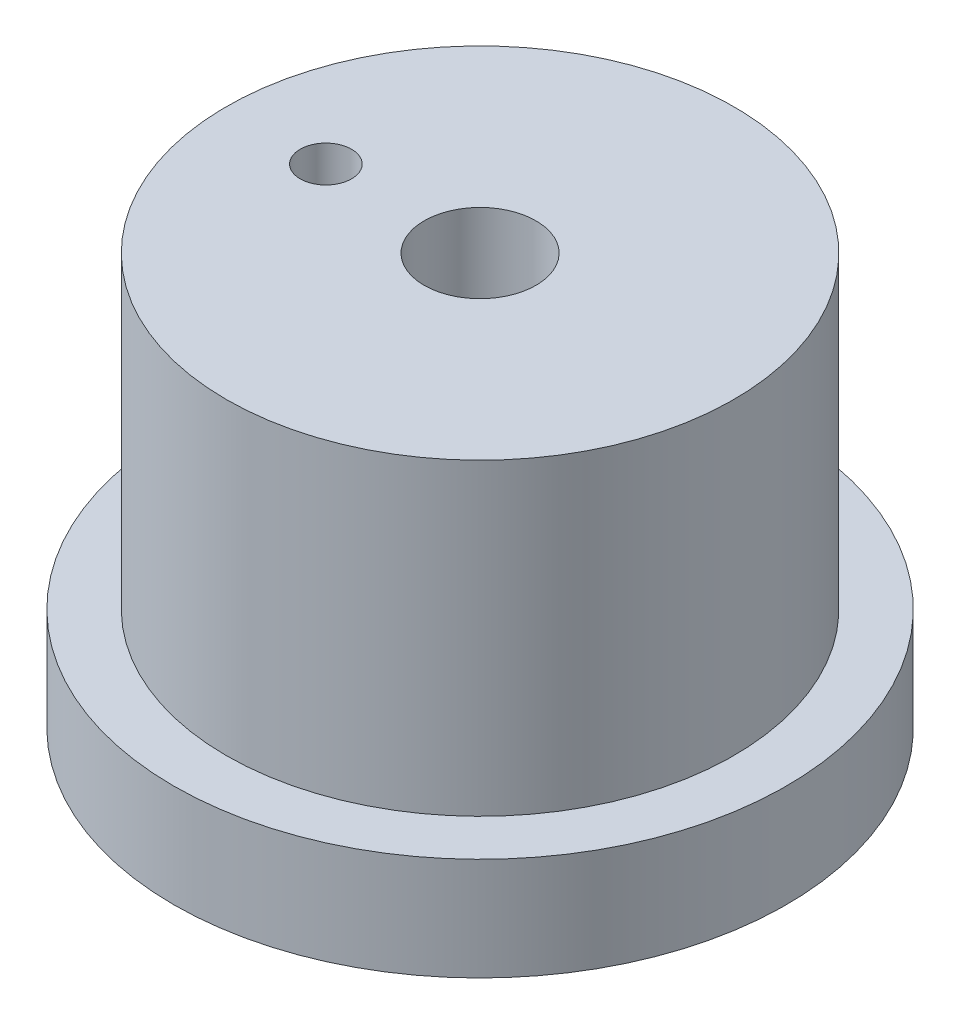
ISO-10303-21;
HEADER;
FILE_DESCRIPTION(('STEP AP214'),'2;1');
FILE_NAME('part.step','',(''),(''),'','','');
FILE_SCHEMA(('AUTOMOTIVE_DESIGN { 1 0 10303 214 1 1 1 1 }'));
ENDSEC;
DATA;
#1=APPLICATION_CONTEXT('core data for automotive mechanical design processes');
#2=APPLICATION_PROTOCOL_DEFINITION('international standard','automotive_design',2000,#1);
#3=PRODUCT_CONTEXT('',#1,'mechanical');
#4=PRODUCT('Part','Part','',(#3));
#5=PRODUCT_RELATED_PRODUCT_CATEGORY('part','',(#4));
#6=PRODUCT_DEFINITION_FORMATION('','',#4);
#7=PRODUCT_DEFINITION_CONTEXT('part definition',#1,'design');
#8=PRODUCT_DEFINITION('design','',#6,#7);
#9=PRODUCT_DEFINITION_SHAPE('','',#8);
#10=(LENGTH_UNIT() NAMED_UNIT(*) SI_UNIT(.MILLI.,.METRE.));
#11=(NAMED_UNIT(*) PLANE_ANGLE_UNIT() SI_UNIT($,.RADIAN.));
#12=(NAMED_UNIT(*) SI_UNIT($,.STERADIAN.) SOLID_ANGLE_UNIT());
#13=UNCERTAINTY_MEASURE_WITH_UNIT(LENGTH_MEASURE(1.E-05),#10,'distance_accuracy_value','');
#14=(GEOMETRIC_REPRESENTATION_CONTEXT(3) GLOBAL_UNCERTAINTY_ASSIGNED_CONTEXT((#13)) GLOBAL_UNIT_ASSIGNED_CONTEXT((#10,
#11,#12)) REPRESENTATION_CONTEXT('',''));
#15=CARTESIAN_POINT('',(0.,0.,0.));
#16=DIRECTION('',(0.,0.,1.));
#17=DIRECTION('',(1.,0.,0.));
#18=AXIS2_PLACEMENT_3D('',#15,#16,#17);
#19=CARTESIAN_POINT('',(0.,3.175,0.));
#20=DIRECTION('',(0.,1.,0.));
#21=DIRECTION('',(0.,0.,1.));
#22=AXIS2_PLACEMENT_3D('',#19,#20,#21);
#23=PLANE('',#22);
#24=CARTESIAN_POINT('',(0.,3.175,0.));
#25=DIRECTION('',(0.,1.,0.));
#26=DIRECTION('',(0.,0.,1.));
#27=AXIS2_PLACEMENT_3D('',#24,#25,#26);
#28=CIRCLE('',#27,9.4615);
#29=CARTESIAN_POINT('',(0.,3.175,9.4615));
#30=VERTEX_POINT('',#29);
#31=EDGE_CURVE('E10',#30,#30,#28,.T.);
#32=ORIENTED_EDGE('',*,*,#31,.T.);
#33=EDGE_LOOP('',(#32));
#34=FACE_BOUND('',#33,.T.);
#35=CARTESIAN_POINT('',(0.,3.175,0.));
#36=DIRECTION('',(0.,1.,0.));
#37=DIRECTION('',(0.,0.,1.));
#38=AXIS2_PLACEMENT_3D('',#35,#36,#37);
#39=CIRCLE('',#38,7.8359);
#40=CARTESIAN_POINT('',(0.,3.175,7.8359));
#41=VERTEX_POINT('',#40);
#42=EDGE_CURVE('E51',#41,#41,#39,.T.);
#43=ORIENTED_EDGE('',*,*,#42,.F.);
#44=EDGE_LOOP('',(#43));
#45=FACE_BOUND('',#44,.T.);
#46=ADVANCED_FACE('F36',(#34,#45),#23,.T.);
#47=CARTESIAN_POINT('',(0.,3.175,0.));
#48=DIRECTION('',(0.,-1.,0.));
#49=DIRECTION('',(0.,0.,-1.));
#50=AXIS2_PLACEMENT_3D('',#47,#48,#49);
#51=CYLINDRICAL_SURFACE('',#50,9.4615);
#52=ORIENTED_EDGE('',*,*,#31,.F.);
#53=EDGE_LOOP('',(#52));
#54=FACE_BOUND('',#53,.T.);
#55=CARTESIAN_POINT('',(0.,0.,0.));
#56=DIRECTION('',(0.,1.,0.));
#57=DIRECTION('',(0.,0.,1.));
#58=AXIS2_PLACEMENT_3D('',#55,#56,#57);
#59=CIRCLE('',#58,9.4615);
#60=CARTESIAN_POINT('',(0.,0.,9.4615));
#61=VERTEX_POINT('',#60);
#62=EDGE_CURVE('E44',#61,#61,#59,.T.);
#63=ORIENTED_EDGE('',*,*,#62,.T.);
#64=EDGE_LOOP('',(#63));
#65=FACE_BOUND('',#64,.T.);
#66=ADVANCED_FACE('F38',(#54,#65),#51,.T.);
#67=CARTESIAN_POINT('',(0.,0.,0.));
#68=DIRECTION('',(0.,1.,0.));
#69=DIRECTION('',(0.,0.,1.));
#70=AXIS2_PLACEMENT_3D('',#67,#68,#69);
#71=PLANE('',#70);
#72=CARTESIAN_POINT('',(0.,0.,0.));
#73=DIRECTION('',(0.,-1.,0.));
#74=DIRECTION('',(0.,0.,-1.));
#75=AXIS2_PLACEMENT_3D('',#72,#73,#74);
#76=CIRCLE('',#75,7.4295);
#77=CARTESIAN_POINT('',(0.,0.,-7.4295));
#78=VERTEX_POINT('',#77);
#79=EDGE_CURVE('E57',#78,#78,#76,.T.);
#80=ORIENTED_EDGE('',*,*,#79,.F.);
#81=EDGE_LOOP('',(#80));
#82=FACE_BOUND('',#81,.T.);
#83=ORIENTED_EDGE('',*,*,#62,.F.);
#84=EDGE_LOOP('',(#83));
#85=FACE_BOUND('',#84,.T.);
#86=ADVANCED_FACE('F93',(#82,#85),#71,.F.);
#87=CARTESIAN_POINT('',(0.,12.7,0.));
#88=DIRECTION('',(0.,-1.,0.));
#89=DIRECTION('',(0.,0.,-1.));
#90=AXIS2_PLACEMENT_3D('',#87,#88,#89);
#91=CYLINDRICAL_SURFACE('',#90,7.8359);
#92=CARTESIAN_POINT('',(0.,12.7,0.));
#93=DIRECTION('',(0.,1.,0.));
#94=DIRECTION('',(0.,0.,1.));
#95=AXIS2_PLACEMENT_3D('',#92,#93,#94);
#96=CIRCLE('',#95,7.8359);
#97=CARTESIAN_POINT('',(0.,12.7,7.8359));
#98=VERTEX_POINT('',#97);
#99=EDGE_CURVE('E49',#98,#98,#96,.T.);
#100=ORIENTED_EDGE('',*,*,#99,.F.);
#101=EDGE_LOOP('',(#100));
#102=FACE_BOUND('',#101,.T.);
#103=ORIENTED_EDGE('',*,*,#42,.T.);
#104=EDGE_LOOP('',(#103));
#105=FACE_BOUND('',#104,.T.);
#106=ADVANCED_FACE('F96',(#102,#105),#91,.T.);
#107=CARTESIAN_POINT('',(0.,12.7,0.));
#108=DIRECTION('',(0.,1.,0.));
#109=DIRECTION('',(0.,0.,1.));
#110=AXIS2_PLACEMENT_3D('',#107,#108,#109);
#111=PLANE('',#110);
#112=CARTESIAN_POINT('',(-4.7625,12.7,0.));
#113=DIRECTION('',(0.,1.,0.));
#114=DIRECTION('',(0.,0.,1.));
#115=AXIS2_PLACEMENT_3D('',#112,#113,#114);
#116=CIRCLE('',#115,0.793749999999998);
#117=CARTESIAN_POINT('',(-4.7625,12.7,0.793749999999998));
#118=VERTEX_POINT('',#117);
#119=EDGE_CURVE('E68',#118,#118,#116,.T.);
#120=ORIENTED_EDGE('',*,*,#119,.F.);
#121=EDGE_LOOP('',(#120));
#122=FACE_BOUND('',#121,.T.);
#123=CARTESIAN_POINT('',(0.,12.7,0.));
#124=DIRECTION('',(0.,1.,0.));
#125=DIRECTION('',(0.,0.,1.));
#126=AXIS2_PLACEMENT_3D('',#123,#124,#125);
#127=CIRCLE('',#126,1.72719999999999);
#128=CARTESIAN_POINT('',(0.,12.7,1.72719999999999));
#129=VERTEX_POINT('',#128);
#130=EDGE_CURVE('E65',#129,#129,#127,.T.);
#131=ORIENTED_EDGE('',*,*,#130,.F.);
#132=EDGE_LOOP('',(#131));
#133=FACE_BOUND('',#132,.T.);
#134=ORIENTED_EDGE('',*,*,#99,.T.);
#135=EDGE_LOOP('',(#134));
#136=FACE_BOUND('',#135,.T.);
#137=ADVANCED_FACE('F89',(#122,#133,#136),#111,.T.);
#138=CARTESIAN_POINT('',(0.,0.635,0.));
#139=DIRECTION('',(0.,-1.,0.));
#140=DIRECTION('',(0.,0.,-1.));
#141=AXIS2_PLACEMENT_3D('',#138,#139,#140);
#142=CYLINDRICAL_SURFACE('',#141,7.4295);
#143=CARTESIAN_POINT('',(0.,0.635,0.));
#144=DIRECTION('',(0.,-1.,0.));
#145=DIRECTION('',(0.,0.,-1.));
#146=AXIS2_PLACEMENT_3D('',#143,#144,#145);
#147=CIRCLE('',#146,7.4295);
#148=CARTESIAN_POINT('',(0.,0.635,-7.4295));
#149=VERTEX_POINT('',#148);
#150=EDGE_CURVE('E54',#149,#149,#147,.T.);
#151=ORIENTED_EDGE('',*,*,#150,.F.);
#152=EDGE_LOOP('',(#151));
#153=FACE_BOUND('',#152,.T.);
#154=ORIENTED_EDGE('',*,*,#79,.T.);
#155=EDGE_LOOP('',(#154));
#156=FACE_BOUND('',#155,.T.);
#157=ADVANCED_FACE('F81',(#153,#156),#142,.F.);
#158=CARTESIAN_POINT('',(0.,0.635,0.));
#159=DIRECTION('',(0.,-1.,0.));
#160=DIRECTION('',(0.,0.,-1.));
#161=AXIS2_PLACEMENT_3D('',#158,#159,#160);
#162=PLANE('',#161);
#163=CARTESIAN_POINT('',(-4.7625,0.635,0.));
#164=DIRECTION('',(0.,-1.,0.));
#165=DIRECTION('',(0.,0.,-1.));
#166=AXIS2_PLACEMENT_3D('',#163,#164,#165);
#167=CIRCLE('',#166,0.793749999999998);
#168=CARTESIAN_POINT('',(-4.7625,0.635,-0.793749999999998));
#169=VERTEX_POINT('',#168);
#170=EDGE_CURVE('E40',#169,#169,#167,.T.);
#171=ORIENTED_EDGE('',*,*,#170,.F.);
#172=EDGE_LOOP('',(#171));
#173=FACE_BOUND('',#172,.T.);
#174=CARTESIAN_POINT('',(0.,0.635,0.));
#175=DIRECTION('',(0.,-1.,0.));
#176=DIRECTION('',(0.,0.,-1.));
#177=AXIS2_PLACEMENT_3D('',#174,#175,#176);
#178=CIRCLE('',#177,1.72719999999999);
#179=CARTESIAN_POINT('',(0.,0.635,-1.72719999999999));
#180=VERTEX_POINT('',#179);
#181=EDGE_CURVE('E60',#180,#180,#178,.T.);
#182=ORIENTED_EDGE('',*,*,#181,.F.);
#183=EDGE_LOOP('',(#182));
#184=FACE_BOUND('',#183,.T.);
#185=ORIENTED_EDGE('',*,*,#150,.T.);
#186=EDGE_LOOP('',(#185));
#187=FACE_BOUND('',#186,.T.);
#188=ADVANCED_FACE('F77',(#173,#184,#187),#162,.T.);
#189=CARTESIAN_POINT('',(0.,12.7,0.));
#190=DIRECTION('',(0.,1.,0.));
#191=DIRECTION('',(0.,0.,1.));
#192=AXIS2_PLACEMENT_3D('',#189,#190,#191);
#193=CYLINDRICAL_SURFACE('',#192,1.72719999999999);
#194=ORIENTED_EDGE('',*,*,#130,.T.);
#195=EDGE_LOOP('',(#194));
#196=FACE_BOUND('',#195,.T.);
#197=ORIENTED_EDGE('',*,*,#181,.T.);
#198=EDGE_LOOP('',(#197));
#199=FACE_BOUND('',#198,.T.);
#200=ADVANCED_FACE('F80',(#196,#199),#193,.F.);
#201=CARTESIAN_POINT('',(-4.7625,12.7,0.));
#202=DIRECTION('',(0.,1.,0.));
#203=DIRECTION('',(0.,0.,1.));
#204=AXIS2_PLACEMENT_3D('',#201,#202,#203);
#205=CYLINDRICAL_SURFACE('',#204,0.793749999999998);
#206=ORIENTED_EDGE('',*,*,#170,.T.);
#207=EDGE_LOOP('',(#206));
#208=FACE_BOUND('',#207,.T.);
#209=ORIENTED_EDGE('',*,*,#119,.T.);
#210=EDGE_LOOP('',(#209));
#211=FACE_BOUND('',#210,.T.);
#212=ADVANCED_FACE('F75',(#208,#211),#205,.F.);
#213=CLOSED_SHELL('',(#46,#66,#86,#106,#137,#157,#188,#200,#212));
#214=MANIFOLD_SOLID_BREP('B2',#213);
#215=ADVANCED_BREP_SHAPE_REPRESENTATION('',(#18,#214),#14);
#216=SHAPE_DEFINITION_REPRESENTATION(#9,#215);
ENDSEC;
END-ISO-10303-21;
